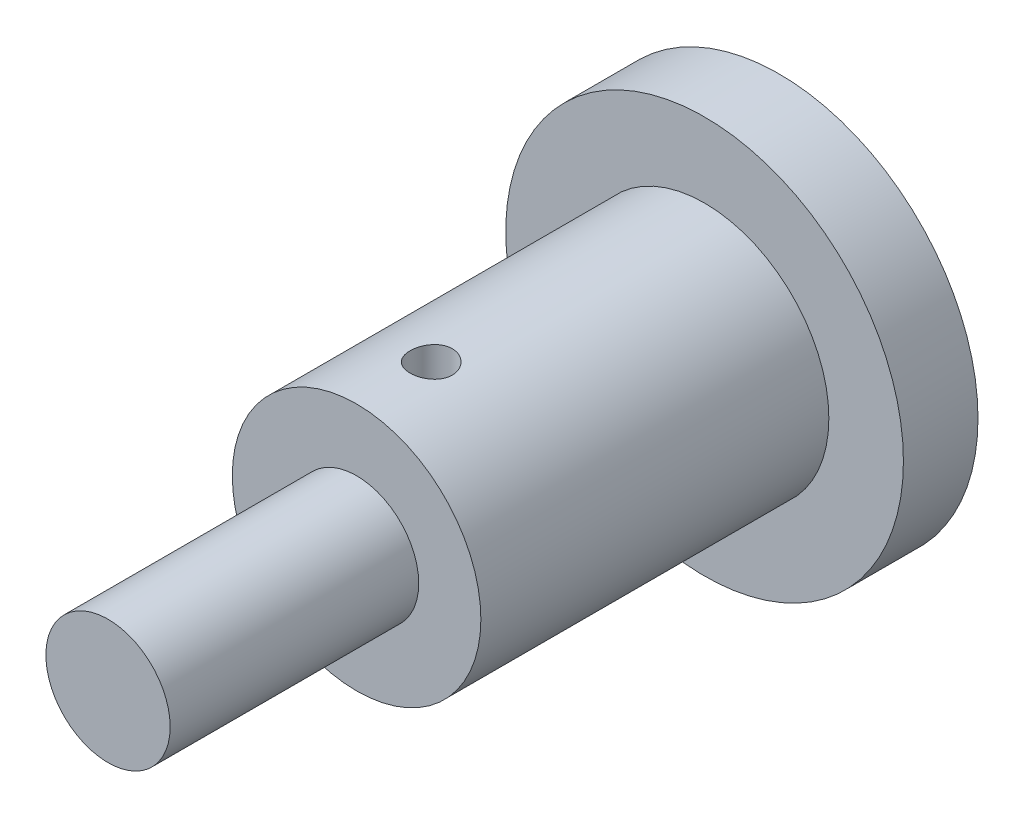
ISO-10303-21;
HEADER;
FILE_DESCRIPTION(('STEP AP214'),'2;1');
FILE_NAME('part.step','',(''),(''),'','','');
FILE_SCHEMA(('AUTOMOTIVE_DESIGN { 1 0 10303 214 1 1 1 1 }'));
ENDSEC;
DATA;
#1=APPLICATION_CONTEXT('core data for automotive mechanical design processes');
#2=APPLICATION_PROTOCOL_DEFINITION('international standard','automotive_design',2000,#1);
#3=PRODUCT_CONTEXT('',#1,'mechanical');
#4=PRODUCT('Part','Part','',(#3));
#5=PRODUCT_RELATED_PRODUCT_CATEGORY('part','',(#4));
#6=PRODUCT_DEFINITION_FORMATION('','',#4);
#7=PRODUCT_DEFINITION_CONTEXT('part definition',#1,'design');
#8=PRODUCT_DEFINITION('design','',#6,#7);
#9=PRODUCT_DEFINITION_SHAPE('','',#8);
#10=(LENGTH_UNIT() NAMED_UNIT(*) SI_UNIT(.MILLI.,.METRE.));
#11=(NAMED_UNIT(*) PLANE_ANGLE_UNIT() SI_UNIT($,.RADIAN.));
#12=(NAMED_UNIT(*) SI_UNIT($,.STERADIAN.) SOLID_ANGLE_UNIT());
#13=UNCERTAINTY_MEASURE_WITH_UNIT(LENGTH_MEASURE(1.E-05),#10,'distance_accuracy_value','');
#14=(GEOMETRIC_REPRESENTATION_CONTEXT(3) GLOBAL_UNCERTAINTY_ASSIGNED_CONTEXT((#13)) GLOBAL_UNIT_ASSIGNED_CONTEXT((#10,
#11,#12)) REPRESENTATION_CONTEXT('',''));
#15=CARTESIAN_POINT('',(0.,0.,0.));
#16=DIRECTION('',(0.,0.,1.));
#17=DIRECTION('',(1.,0.,0.));
#18=AXIS2_PLACEMENT_3D('',#15,#16,#17);
#19=CARTESIAN_POINT('',(0.,0.,17.));
#20=DIRECTION('',(0.,0.,1.));
#21=DIRECTION('',(1.,0.,0.));
#22=AXIS2_PLACEMENT_3D('',#19,#20,#21);
#23=PLANE('',#22);
#24=CARTESIAN_POINT('',(0.,0.,17.));
#25=DIRECTION('',(0.,0.,1.));
#26=DIRECTION('',(1.,0.,0.));
#27=AXIS2_PLACEMENT_3D('',#24,#25,#26);
#28=CIRCLE('',#27,5.);
#29=CARTESIAN_POINT('',(5.,0.,17.));
#30=VERTEX_POINT('',#29);
#31=EDGE_CURVE('E47',#30,#30,#28,.T.);
#32=ORIENTED_EDGE('',*,*,#31,.T.);
#33=EDGE_LOOP('',(#32));
#34=FACE_BOUND('',#33,.T.);
#35=CARTESIAN_POINT('',(0.,0.,17.));
#36=DIRECTION('',(0.,0.,1.));
#37=DIRECTION('',(1.,0.,0.));
#38=AXIS2_PLACEMENT_3D('',#35,#36,#37);
#39=CIRCLE('',#38,2.5);
#40=CARTESIAN_POINT('',(2.5,0.,17.));
#41=VERTEX_POINT('',#40);
#42=EDGE_CURVE('E84',#41,#41,#39,.T.);
#43=ORIENTED_EDGE('',*,*,#42,.F.);
#44=EDGE_LOOP('',(#43));
#45=FACE_BOUND('',#44,.T.);
#46=ADVANCED_FACE('F30',(#34,#45),#23,.T.);
#47=CARTESIAN_POINT('',(0.,0.,3.));
#48=DIRECTION('',(0.,0.,1.));
#49=DIRECTION('',(1.,0.,0.));
#50=AXIS2_PLACEMENT_3D('',#47,#48,#49);
#51=PLANE('',#50);
#52=CARTESIAN_POINT('',(0.,0.,3.));
#53=DIRECTION('',(0.,0.,1.));
#54=DIRECTION('',(1.,0.,0.));
#55=AXIS2_PLACEMENT_3D('',#52,#53,#54);
#56=CIRCLE('',#55,8.);
#57=CARTESIAN_POINT('',(8.,0.,3.));
#58=VERTEX_POINT('',#57);
#59=EDGE_CURVE('E10',#58,#58,#56,.T.);
#60=ORIENTED_EDGE('',*,*,#59,.T.);
#61=EDGE_LOOP('',(#60));
#62=FACE_BOUND('',#61,.T.);
#63=CARTESIAN_POINT('',(0.,0.,3.));
#64=DIRECTION('',(0.,0.,1.));
#65=DIRECTION('',(1.,0.,0.));
#66=AXIS2_PLACEMENT_3D('',#63,#64,#65);
#67=CIRCLE('',#66,5.);
#68=CARTESIAN_POINT('',(5.,0.,3.));
#69=VERTEX_POINT('',#68);
#70=EDGE_CURVE('E50',#69,#69,#67,.T.);
#71=ORIENTED_EDGE('',*,*,#70,.F.);
#72=EDGE_LOOP('',(#71));
#73=FACE_BOUND('',#72,.T.);
#74=ADVANCED_FACE('F74',(#62,#73),#51,.T.);
#75=CARTESIAN_POINT('',(0.,0.,3.));
#76=DIRECTION('',(0.,0.,-1.));
#77=DIRECTION('',(-1.,0.,0.));
#78=AXIS2_PLACEMENT_3D('',#75,#76,#77);
#79=CYLINDRICAL_SURFACE('',#78,8.);
#80=ORIENTED_EDGE('',*,*,#59,.F.);
#81=EDGE_LOOP('',(#80));
#82=FACE_BOUND('',#81,.T.);
#83=CARTESIAN_POINT('',(0.,0.,0.));
#84=DIRECTION('',(0.,0.,1.));
#85=DIRECTION('',(1.,0.,0.));
#86=AXIS2_PLACEMENT_3D('',#83,#84,#85);
#87=CIRCLE('',#86,8.);
#88=CARTESIAN_POINT('',(8.,0.,0.));
#89=VERTEX_POINT('',#88);
#90=EDGE_CURVE('E42',#89,#89,#87,.T.);
#91=ORIENTED_EDGE('',*,*,#90,.T.);
#92=EDGE_LOOP('',(#91));
#93=FACE_BOUND('',#92,.T.);
#94=ADVANCED_FACE('F32',(#82,#93),#79,.T.);
#95=CARTESIAN_POINT('',(0.,0.,0.));
#96=DIRECTION('',(0.,0.,1.));
#97=DIRECTION('',(1.,0.,0.));
#98=AXIS2_PLACEMENT_3D('',#95,#96,#97);
#99=PLANE('',#98);
#100=ORIENTED_EDGE('',*,*,#90,.F.);
#101=EDGE_LOOP('',(#100));
#102=FACE_BOUND('',#101,.T.);
#103=ADVANCED_FACE('F96',(#102),#99,.F.);
#104=CARTESIAN_POINT('',(0.,0.,17.));
#105=DIRECTION('',(0.,0.,-1.));
#106=DIRECTION('',(-1.,0.,0.));
#107=AXIS2_PLACEMENT_3D('',#104,#105,#106);
#108=CYLINDRICAL_SURFACE('',#107,5.);
#109=CARTESIAN_POINT('',(0.,-5.,14.85));
#110=CARTESIAN_POINT('',(0.0473788439473028,-4.99999917925239,14.8499981128659));
#111=CARTESIAN_POINT('',(0.0947831958958586,-4.99931956826631,14.8460252853134));
#112=CARTESIAN_POINT('',(0.188261396798917,-4.99667391756309,14.8302461020935));
#113=CARTESIAN_POINT('',(0.234333997908397,-4.99470670972554,14.8184326331834));
#114=CARTESIAN_POINT('',(0.323782817085856,-4.98970642381031,14.7873399607164));
#115=CARTESIAN_POINT('',(0.36716124139174,-4.98667423175172,14.7680669617987));
#116=CARTESIAN_POINT('',(0.450063342401866,-4.97987702628971,14.722618779578));
#117=CARTESIAN_POINT('',(0.489587439497901,-4.97611209294094,14.6964443501706));
#118=CARTESIAN_POINT('',(0.564056697446354,-4.96822469645979,14.6376599209988));
#119=CARTESIAN_POINT('',(0.598958035363363,-4.96409935284978,14.6049947860894));
#120=CARTESIAN_POINT('',(0.662812420997252,-4.95597803179776,14.5342748551628));
#121=CARTESIAN_POINT('',(0.691765085686636,-4.95198206269994,14.4962197123562));
#122=CARTESIAN_POINT('',(0.743076909594573,-4.94454402012044,14.4154976442008));
#123=CARTESIAN_POINT('',(0.765392543219735,-4.94110566751868,14.3728026785417));
#124=CARTESIAN_POINT('',(0.802518462557784,-4.93521222332118,14.2842019470287));
#125=CARTESIAN_POINT('',(0.817329276325865,-4.93275706254849,14.2382964073365));
#126=CARTESIAN_POINT('',(0.838886661522425,-4.92913670867222,14.1450428408422));
#127=CARTESIAN_POINT('',(0.845709010759179,-4.92795940191059,14.0977128108024));
#128=CARTESIAN_POINT('',(0.851330795091087,-4.92699143022252,14.0025662867587));
#129=CARTESIAN_POINT('',(0.85013082089276,-4.9272006632012,13.9547498288307));
#130=CARTESIAN_POINT('',(0.83980370216209,-4.92897107502636,13.8605299436878));
#131=CARTESIAN_POINT('',(0.830761840794577,-4.93051770865579,13.8141168556998));
#132=CARTESIAN_POINT('',(0.805141523124402,-4.93476587508514,13.7234761980545));
#133=CARTESIAN_POINT('',(0.788562798829836,-4.93746744895162,13.6792487061735));
#134=CARTESIAN_POINT('',(0.748253368803819,-4.94373673151079,13.5939802683119));
#135=CARTESIAN_POINT('',(0.724487398657078,-4.94730869360632,13.5529563186692));
#136=CARTESIAN_POINT('',(0.670503127786657,-4.95491335157996,13.4754463206931));
#137=CARTESIAN_POINT('',(0.640284285750301,-4.95894608609772,13.4389606534696));
#138=CARTESIAN_POINT('',(0.57378814756751,-4.96708173190499,13.3710693923387));
#139=CARTESIAN_POINT('',(0.537437713445017,-4.97118487730641,13.3397354173705));
#140=CARTESIAN_POINT('',(0.459957201394336,-4.97895097023888,13.2836007224758));
#141=CARTESIAN_POINT('',(0.418827090319627,-4.98261391471683,13.258800047861));
#142=CARTESIAN_POINT('',(0.332886296297798,-4.98909240776393,13.2164288264496));
#143=CARTESIAN_POINT('',(0.288072348880967,-4.99190719419737,13.1988647771473));
#144=CARTESIAN_POINT('',(0.196072036345872,-4.99636614081758,13.1715327515934));
#145=CARTESIAN_POINT('',(0.14888587819407,-4.9980104029391,13.1617640964735));
#146=CARTESIAN_POINT('',(0.054097701497682,-4.99992928531431,13.1503976391189));
#147=CARTESIAN_POINT('',(0.00650779117117954,-5.00022038024891,13.1487015480816));
#148=CARTESIAN_POINT('',(-0.0882761043086984,-4.99944531131192,13.1532660779694));
#149=CARTESIAN_POINT('',(-0.135470105257126,-4.99837920184856,13.159526379935));
#150=CARTESIAN_POINT('',(-0.22781767717324,-4.9950197220779,13.1797442403527));
#151=CARTESIAN_POINT('',(-0.272982245259969,-4.99273413916824,13.1936529740055));
#152=CARTESIAN_POINT('',(-0.360338535313018,-4.98719095020585,13.2287207112627));
#153=CARTESIAN_POINT('',(-0.402530084611106,-4.98393328775372,13.249880135558));
#154=CARTESIAN_POINT('',(-0.483168473970904,-4.97676639840218,13.2990725704202));
#155=CARTESIAN_POINT('',(-0.521577467875027,-4.97285147591719,13.3271667741234));
#156=CARTESIAN_POINT('',(-0.593170891465076,-4.96482109348013,13.3893473103336));
#157=CARTESIAN_POINT('',(-0.62635492497834,-4.96070561835248,13.4234340968024));
#158=CARTESIAN_POINT('',(-0.68692219425662,-4.95268448639706,13.4970736780406));
#159=CARTESIAN_POINT('',(-0.714238916185859,-4.94878157539004,13.5366815259231));
#160=CARTESIAN_POINT('',(-0.76183113712498,-4.94167934409434,13.6199815320807));
#161=CARTESIAN_POINT('',(-0.782106865774054,-4.93848000086034,13.6636735570931));
#162=CARTESIAN_POINT('',(-0.814942850034579,-4.93316789570806,13.7537182991226));
#163=CARTESIAN_POINT('',(-0.827535812004868,-4.93105053402667,13.8000588056537));
#164=CARTESIAN_POINT('',(-0.84475142940668,-4.92813073968938,13.894236463773));
#165=CARTESIAN_POINT('',(-0.849374808596533,-4.92732818762925,13.9420734790537));
#166=CARTESIAN_POINT('',(-0.850499214036234,-4.92713416782882,14.0372217538618));
#167=CARTESIAN_POINT('',(-0.847104966796993,-4.92772450599574,14.084531771176));
#168=CARTESIAN_POINT('',(-0.832517353879762,-4.93020980422301,14.1778969998944));
#169=CARTESIAN_POINT('',(-0.821324016468519,-4.93210475955496,14.2239522158459));
#170=CARTESIAN_POINT('',(-0.79149671479885,-4.93697874874625,14.3134575827244));
#171=CARTESIAN_POINT('',(-0.772872123672843,-4.93995641654886,14.356910936308));
#172=CARTESIAN_POINT('',(-0.728721852289554,-4.9466615862885,14.4400931611663));
#173=CARTESIAN_POINT('',(-0.703195807159172,-4.95038912786795,14.4798218353713));
#174=CARTESIAN_POINT('',(-0.64559492551228,-4.95823154448424,14.5549553852686));
#175=CARTESIAN_POINT('',(-0.613443164619046,-4.96235063156662,14.5903008562205));
#176=CARTESIAN_POINT('',(-0.543665492457055,-4.97047875157248,14.6551306175086));
#177=CARTESIAN_POINT('',(-0.506038320962386,-4.9744877589067,14.6846135548113));
#178=CARTESIAN_POINT('',(-0.426054793269094,-4.98197760229193,14.7370764789307));
#179=CARTESIAN_POINT('',(-0.383666275991167,-4.9854544190697,14.7600080142744));
#180=CARTESIAN_POINT('',(-0.295596295575401,-4.99144902713807,14.798389356677));
#181=CARTESIAN_POINT('',(-0.249918135319488,-4.99396776482861,14.8138465510798));
#182=CARTESIAN_POINT('',(-0.170057286573805,-4.99721823500957,14.8335181612412));
#183=CARTESIAN_POINT('',(-0.136355404034402,-4.99825577361274,14.8396888527237));
#184=CARTESIAN_POINT('',(-0.0684401120100735,-4.99964694629028,14.8479304161312));
#185=CARTESIAN_POINT('',(-0.0342267119216703,-5.00000059291215,14.850001363275));
#186=CARTESIAN_POINT('',(0.,-5.,14.85));
#187=B_SPLINE_CURVE_WITH_KNOTS('',3,(#109,#110,#111,#112,#113,#114,#115,#116,#117,#118,#119,
#120,#121,#122,#123,#124,#125,#126,#127,#128,#129,#130,#131,#132,#133,#134,#135,#136,#137,#138,
#139,#140,#141,#142,#143,#144,#145,#146,#147,#148,#149,#150,#151,#152,#153,#154,#155,#156,#157,
#158,#159,#160,#161,#162,#163,#164,#165,#166,#167,#168,#169,#170,#171,#172,#173,#174,#175,#176,
#177,#178,#179,#180,#181,#182,#183,#184,#185,#186),.UNSPECIFIED.,.T.,.F.,(4,2,2,2,2,2,2,2,2,2,2,
2,2,2,2,2,2,2,2,2,2,2,2,2,2,2,2,2,2,2,2,2,2,2,2,2,2,2,4),(0.,0.142011414219269,
0.284151841479429,0.426174293302892,0.56818123735953,0.711450422028872,0.854728828729669,
0.998927123194738,1.14311527014966,1.28592428786667,1.42872279026487,1.56998751211335,
1.71125725737323,1.85323171300029,1.99521808313394,2.13903641731052,2.28285574891056,
2.42680393055898,2.57073957499193,2.71291814553209,2.85509101653254,2.99636666976048,
3.13765052130378,3.28022867408672,3.42281763238575,3.566946434048,3.71107053456518,
3.85457672230416,3.99806987682988,4.13969910377105,4.28132781739894,4.42277845483919,
4.56423657209866,4.70744026543338,4.85067697095683,4.99494708620417,5.13907431762039,
5.24166595008136,5.34425570025504),.UNSPECIFIED.);
#188=CARTESIAN_POINT('',(0.,-5.,14.85));
#189=VERTEX_POINT('',#188);
#190=EDGE_CURVE('E34',#189,#189,#187,.T.);
#191=ORIENTED_EDGE('',*,*,#190,.T.);
#192=EDGE_LOOP('',(#191));
#193=FACE_BOUND('',#192,.T.);
#194=CARTESIAN_POINT('',(0.,5.,14.85));
#195=CARTESIAN_POINT('',(-0.0473788439473028,4.99999917925239,14.8499981128659));
#196=CARTESIAN_POINT('',(-0.0947831958958586,4.99931956826631,14.8460252853134));
#197=CARTESIAN_POINT('',(-0.188261396798917,4.99667391756309,14.8302461020935));
#198=CARTESIAN_POINT('',(-0.234333997908397,4.99470670972554,14.8184326331834));
#199=CARTESIAN_POINT('',(-0.323782817085856,4.98970642381031,14.7873399607164));
#200=CARTESIAN_POINT('',(-0.36716124139174,4.98667423175172,14.7680669617987));
#201=CARTESIAN_POINT('',(-0.450063342401866,4.97987702628971,14.722618779578));
#202=CARTESIAN_POINT('',(-0.489587439497901,4.97611209294094,14.6964443501706));
#203=CARTESIAN_POINT('',(-0.564056697446354,4.96822469645979,14.6376599209988));
#204=CARTESIAN_POINT('',(-0.598958035363363,4.96409935284978,14.6049947860894));
#205=CARTESIAN_POINT('',(-0.662812420997252,4.95597803179776,14.5342748551628));
#206=CARTESIAN_POINT('',(-0.691765085686636,4.95198206269994,14.4962197123562));
#207=CARTESIAN_POINT('',(-0.743076909594573,4.94454402012044,14.4154976442008));
#208=CARTESIAN_POINT('',(-0.765392543219735,4.94110566751868,14.3728026785417));
#209=CARTESIAN_POINT('',(-0.802518462557784,4.93521222332118,14.2842019470287));
#210=CARTESIAN_POINT('',(-0.817329276325865,4.93275706254849,14.2382964073365));
#211=CARTESIAN_POINT('',(-0.838886661522425,4.92913670867222,14.1450428408422));
#212=CARTESIAN_POINT('',(-0.845709010759179,4.92795940191059,14.0977128108024));
#213=CARTESIAN_POINT('',(-0.851330795091087,4.92699143022252,14.0025662867587));
#214=CARTESIAN_POINT('',(-0.85013082089276,4.9272006632012,13.9547498288307));
#215=CARTESIAN_POINT('',(-0.83980370216209,4.92897107502636,13.8605299436878));
#216=CARTESIAN_POINT('',(-0.830761840794577,4.93051770865579,13.8141168556998));
#217=CARTESIAN_POINT('',(-0.805141523124402,4.93476587508514,13.7234761980545));
#218=CARTESIAN_POINT('',(-0.788562798829836,4.93746744895162,13.6792487061735));
#219=CARTESIAN_POINT('',(-0.748253368803819,4.94373673151079,13.5939802683119));
#220=CARTESIAN_POINT('',(-0.724487398657078,4.94730869360632,13.5529563186692));
#221=CARTESIAN_POINT('',(-0.670503127786657,4.95491335157996,13.4754463206931));
#222=CARTESIAN_POINT('',(-0.640284285750301,4.95894608609772,13.4389606534696));
#223=CARTESIAN_POINT('',(-0.57378814756751,4.96708173190499,13.3710693923387));
#224=CARTESIAN_POINT('',(-0.537437713445017,4.97118487730641,13.3397354173705));
#225=CARTESIAN_POINT('',(-0.459957201394336,4.97895097023888,13.2836007224758));
#226=CARTESIAN_POINT('',(-0.418827090319627,4.98261391471683,13.258800047861));
#227=CARTESIAN_POINT('',(-0.332886296297798,4.98909240776393,13.2164288264496));
#228=CARTESIAN_POINT('',(-0.288072348880967,4.99190719419737,13.1988647771473));
#229=CARTESIAN_POINT('',(-0.196072036345872,4.99636614081758,13.1715327515934));
#230=CARTESIAN_POINT('',(-0.14888587819407,4.9980104029391,13.1617640964735));
#231=CARTESIAN_POINT('',(-0.054097701497682,4.99992928531431,13.1503976391189));
#232=CARTESIAN_POINT('',(-0.00650779117117954,5.00022038024891,13.1487015480816));
#233=CARTESIAN_POINT('',(0.0882761043086984,4.99944531131192,13.1532660779694));
#234=CARTESIAN_POINT('',(0.135470105257126,4.99837920184856,13.159526379935));
#235=CARTESIAN_POINT('',(0.22781767717324,4.9950197220779,13.1797442403527));
#236=CARTESIAN_POINT('',(0.272982245259969,4.99273413916824,13.1936529740055));
#237=CARTESIAN_POINT('',(0.360338535313018,4.98719095020585,13.2287207112627));
#238=CARTESIAN_POINT('',(0.402530084611106,4.98393328775372,13.249880135558));
#239=CARTESIAN_POINT('',(0.483168473970904,4.97676639840218,13.2990725704202));
#240=CARTESIAN_POINT('',(0.521577467875027,4.97285147591719,13.3271667741234));
#241=CARTESIAN_POINT('',(0.593170891465076,4.96482109348013,13.3893473103336));
#242=CARTESIAN_POINT('',(0.62635492497834,4.96070561835248,13.4234340968024));
#243=CARTESIAN_POINT('',(0.68692219425662,4.95268448639706,13.4970736780406));
#244=CARTESIAN_POINT('',(0.714238916185859,4.94878157539004,13.5366815259231));
#245=CARTESIAN_POINT('',(0.76183113712498,4.94167934409434,13.6199815320807));
#246=CARTESIAN_POINT('',(0.782106865774054,4.93848000086034,13.6636735570931));
#247=CARTESIAN_POINT('',(0.814942850034579,4.93316789570806,13.7537182991226));
#248=CARTESIAN_POINT('',(0.827535812004868,4.93105053402667,13.8000588056537));
#249=CARTESIAN_POINT('',(0.84475142940668,4.92813073968938,13.894236463773));
#250=CARTESIAN_POINT('',(0.849374808596533,4.92732818762925,13.9420734790537));
#251=CARTESIAN_POINT('',(0.850499214036234,4.92713416782882,14.0372217538618));
#252=CARTESIAN_POINT('',(0.847104966796993,4.92772450599574,14.084531771176));
#253=CARTESIAN_POINT('',(0.832517353879762,4.93020980422301,14.1778969998944));
#254=CARTESIAN_POINT('',(0.821324016468519,4.93210475955496,14.2239522158459));
#255=CARTESIAN_POINT('',(0.79149671479885,4.93697874874625,14.3134575827244));
#256=CARTESIAN_POINT('',(0.772872123672843,4.93995641654886,14.356910936308));
#257=CARTESIAN_POINT('',(0.728721852289554,4.9466615862885,14.4400931611663));
#258=CARTESIAN_POINT('',(0.703195807159172,4.95038912786795,14.4798218353713));
#259=CARTESIAN_POINT('',(0.64559492551228,4.95823154448424,14.5549553852686));
#260=CARTESIAN_POINT('',(0.613443164619046,4.96235063156662,14.5903008562205));
#261=CARTESIAN_POINT('',(0.543665492457055,4.97047875157248,14.6551306175086));
#262=CARTESIAN_POINT('',(0.506038320962386,4.9744877589067,14.6846135548113));
#263=CARTESIAN_POINT('',(0.426054793269094,4.98197760229193,14.7370764789307));
#264=CARTESIAN_POINT('',(0.383666275991167,4.9854544190697,14.7600080142744));
#265=CARTESIAN_POINT('',(0.295596295575401,4.99144902713807,14.798389356677));
#266=CARTESIAN_POINT('',(0.249918135319488,4.99396776482861,14.8138465510798));
#267=CARTESIAN_POINT('',(0.170057286573805,4.99721823500957,14.8335181612412));
#268=CARTESIAN_POINT('',(0.136355404034402,4.99825577361274,14.8396888527237));
#269=CARTESIAN_POINT('',(0.0684401120100735,4.99964694629028,14.8479304161312));
#270=CARTESIAN_POINT('',(0.0342267119216703,5.00000059291215,14.850001363275));
#271=CARTESIAN_POINT('',(0.,5.,14.85));
#272=B_SPLINE_CURVE_WITH_KNOTS('',3,(#194,#195,#196,#197,#198,#199,#200,#201,#202,#203,#204,
#205,#206,#207,#208,#209,#210,#211,#212,#213,#214,#215,#216,#217,#218,#219,#220,#221,#222,#223,
#224,#225,#226,#227,#228,#229,#230,#231,#232,#233,#234,#235,#236,#237,#238,#239,#240,#241,#242,
#243,#244,#245,#246,#247,#248,#249,#250,#251,#252,#253,#254,#255,#256,#257,#258,#259,#260,#261,
#262,#263,#264,#265,#266,#267,#268,#269,#270,#271),.UNSPECIFIED.,.T.,.F.,(4,2,2,2,2,2,2,2,2,2,2,
2,2,2,2,2,2,2,2,2,2,2,2,2,2,2,2,2,2,2,2,2,2,2,2,2,2,2,4),(0.,0.142011414219269,
0.284151841479429,0.426174293302892,0.56818123735953,0.711450422028872,0.854728828729669,
0.998927123194738,1.14311527014966,1.28592428786667,1.42872279026487,1.56998751211335,
1.71125725737323,1.85323171300029,1.99521808313394,2.13903641731052,2.28285574891056,
2.42680393055898,2.57073957499193,2.71291814553209,2.85509101653254,2.99636666976048,
3.13765052130378,3.28022867408672,3.42281763238575,3.566946434048,3.71107053456518,
3.85457672230416,3.99806987682988,4.13969910377105,4.28132781739894,4.42277845483919,
4.56423657209866,4.70744026543338,4.85067697095683,4.99494708620417,5.13907431762039,
5.24166595008136,5.34425570025504),.UNSPECIFIED.);
#273=CARTESIAN_POINT('',(0.,5.,14.85));
#274=VERTEX_POINT('',#273);
#275=EDGE_CURVE('E52',#274,#274,#272,.T.);
#276=ORIENTED_EDGE('',*,*,#275,.T.);
#277=EDGE_LOOP('',(#276));
#278=FACE_BOUND('',#277,.T.);
#279=ORIENTED_EDGE('',*,*,#31,.F.);
#280=EDGE_LOOP('',(#279));
#281=FACE_BOUND('',#280,.T.);
#282=ORIENTED_EDGE('',*,*,#70,.T.);
#283=EDGE_LOOP('',(#282));
#284=FACE_BOUND('',#283,.T.);
#285=ADVANCED_FACE('F56',(#193,#278,#281,#284),#108,.T.);
#286=CARTESIAN_POINT('',(0.,0.,27.));
#287=DIRECTION('',(0.,0.,-1.));
#288=DIRECTION('',(-1.,0.,0.));
#289=AXIS2_PLACEMENT_3D('',#286,#287,#288);
#290=CYLINDRICAL_SURFACE('',#289,2.5);
#291=CARTESIAN_POINT('',(0.,0.,27.));
#292=DIRECTION('',(0.,0.,1.));
#293=DIRECTION('',(1.,0.,0.));
#294=AXIS2_PLACEMENT_3D('',#291,#292,#293);
#295=CIRCLE('',#294,2.5);
#296=CARTESIAN_POINT('',(2.5,0.,27.));
#297=VERTEX_POINT('',#296);
#298=EDGE_CURVE('E86',#297,#297,#295,.T.);
#299=ORIENTED_EDGE('',*,*,#298,.F.);
#300=EDGE_LOOP('',(#299));
#301=FACE_BOUND('',#300,.T.);
#302=ORIENTED_EDGE('',*,*,#42,.T.);
#303=EDGE_LOOP('',(#302));
#304=FACE_BOUND('',#303,.T.);
#305=ADVANCED_FACE('F69',(#301,#304),#290,.T.);
#306=CARTESIAN_POINT('',(0.,0.,27.));
#307=DIRECTION('',(0.,0.,1.));
#308=DIRECTION('',(1.,0.,0.));
#309=AXIS2_PLACEMENT_3D('',#306,#307,#308);
#310=PLANE('',#309);
#311=ORIENTED_EDGE('',*,*,#298,.T.);
#312=EDGE_LOOP('',(#311));
#313=FACE_BOUND('',#312,.T.);
#314=ADVANCED_FACE('F64',(#313),#310,.T.);
#315=CARTESIAN_POINT('',(0.,-7.5,14.));
#316=DIRECTION('',(0.,1.,0.));
#317=DIRECTION('',(0.,0.,1.));
#318=AXIS2_PLACEMENT_3D('',#315,#316,#317);
#319=CYLINDRICAL_SURFACE('',#318,0.85);
#320=ORIENTED_EDGE('',*,*,#275,.F.);
#321=EDGE_LOOP('',(#320));
#322=FACE_BOUND('',#321,.T.);
#323=ORIENTED_EDGE('',*,*,#190,.F.);
#324=EDGE_LOOP('',(#323));
#325=FACE_BOUND('',#324,.T.);
#326=ADVANCED_FACE('F60',(#322,#325),#319,.F.);
#327=CLOSED_SHELL('',(#46,#74,#94,#103,#285,#305,#314,#326));
#328=MANIFOLD_SOLID_BREP('B2',#327);
#329=ADVANCED_BREP_SHAPE_REPRESENTATION('',(#18,#328),#14);
#330=SHAPE_DEFINITION_REPRESENTATION(#9,#329);
ENDSEC;
END-ISO-10303-21;
